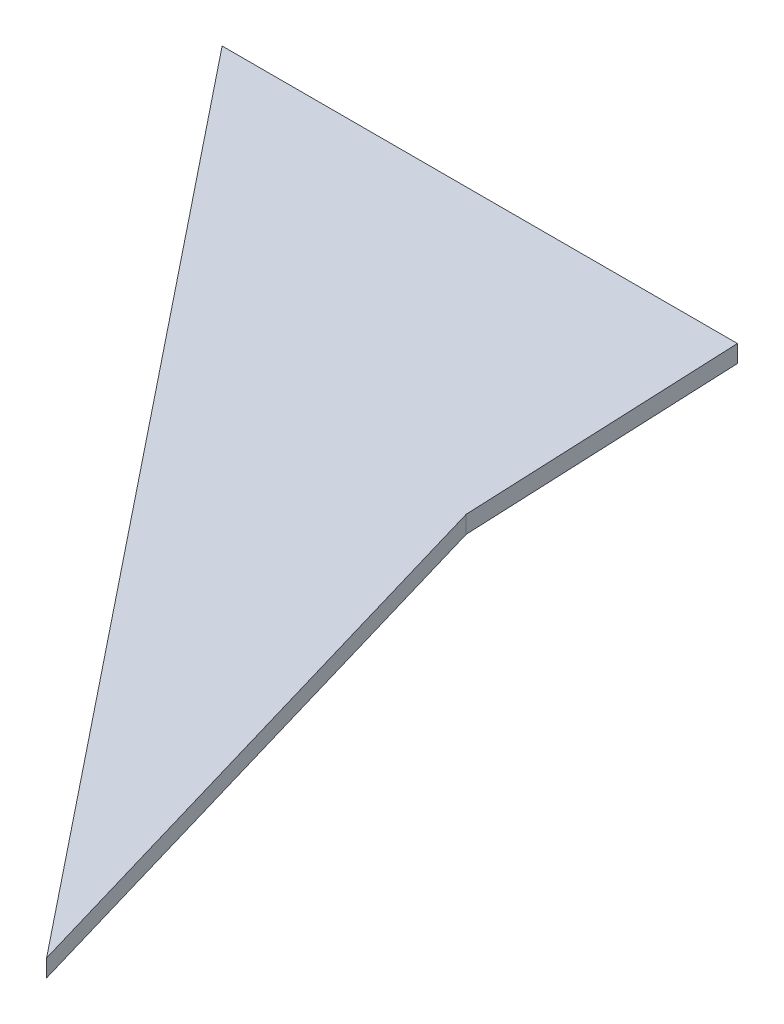
ISO-10303-21;
HEADER;
FILE_DESCRIPTION(('STEP AP214'),'2;1');
FILE_NAME('part.step','',(''),(''),'','','');
FILE_SCHEMA(('AUTOMOTIVE_DESIGN { 1 0 10303 214 1 1 1 1 }'));
ENDSEC;
DATA;
#1=APPLICATION_CONTEXT('core data for automotive mechanical design processes');
#2=APPLICATION_PROTOCOL_DEFINITION('international standard','automotive_design',2000,#1);
#3=PRODUCT_CONTEXT('',#1,'mechanical');
#4=PRODUCT('Part','Part','',(#3));
#5=PRODUCT_RELATED_PRODUCT_CATEGORY('part','',(#4));
#6=PRODUCT_DEFINITION_FORMATION('','',#4);
#7=PRODUCT_DEFINITION_CONTEXT('part definition',#1,'design');
#8=PRODUCT_DEFINITION('design','',#6,#7);
#9=PRODUCT_DEFINITION_SHAPE('','',#8);
#10=(LENGTH_UNIT() NAMED_UNIT(*) SI_UNIT(.MILLI.,.METRE.));
#11=(NAMED_UNIT(*) PLANE_ANGLE_UNIT() SI_UNIT($,.RADIAN.));
#12=(NAMED_UNIT(*) SI_UNIT($,.STERADIAN.) SOLID_ANGLE_UNIT());
#13=UNCERTAINTY_MEASURE_WITH_UNIT(LENGTH_MEASURE(1.E-05),#10,'distance_accuracy_value','');
#14=(GEOMETRIC_REPRESENTATION_CONTEXT(3) GLOBAL_UNCERTAINTY_ASSIGNED_CONTEXT((#13)) GLOBAL_UNIT_ASSIGNED_CONTEXT((#10,
#11,#12)) REPRESENTATION_CONTEXT('',''));
#15=CARTESIAN_POINT('',(0.,0.,0.));
#16=DIRECTION('',(0.,0.,1.));
#17=DIRECTION('',(1.,0.,0.));
#18=AXIS2_PLACEMENT_3D('',#15,#16,#17);
#19=CARTESIAN_POINT('',(59.3342500833334,2.,0.));
#20=DIRECTION('',(0.,0.,1.));
#21=DIRECTION('',(1.,0.,0.));
#22=AXIS2_PLACEMENT_3D('',#19,#20,#21);
#23=PLANE('',#22);
#24=DIRECTION('',(-1.,0.,0.));
#25=VECTOR('',#24,1.);
#26=CARTESIAN_POINT('',(59.3342500833334,0.,0.));
#27=LINE('',#26,#25);
#28=CARTESIAN_POINT('',(59.3342500833334,0.,0.));
#29=VERTEX_POINT('',#28);
#30=CARTESIAN_POINT('',(0.,0.,0.));
#31=VERTEX_POINT('',#30);
#32=EDGE_CURVE('E107',#29,#31,#27,.T.);
#33=ORIENTED_EDGE('',*,*,#32,.T.);
#34=DIRECTION('',(0.,-1.,0.));
#35=VECTOR('',#34,1.);
#36=CARTESIAN_POINT('',(0.,2.,0.));
#37=LINE('',#36,#35);
#38=CARTESIAN_POINT('',(0.,2.,0.));
#39=VERTEX_POINT('',#38);
#40=EDGE_CURVE('E11',#39,#31,#37,.T.);
#41=ORIENTED_EDGE('',*,*,#40,.F.);
#42=DIRECTION('',(-1.,0.,0.));
#43=VECTOR('',#42,1.);
#44=CARTESIAN_POINT('',(59.3342500833334,2.,0.));
#45=LINE('',#44,#43);
#46=CARTESIAN_POINT('',(59.3342500833334,2.,0.));
#47=VERTEX_POINT('',#46);
#48=EDGE_CURVE('E91',#47,#39,#45,.T.);
#49=ORIENTED_EDGE('',*,*,#48,.F.);
#50=DIRECTION('',(0.,-1.,0.));
#51=VECTOR('',#50,1.);
#52=CARTESIAN_POINT('',(59.3342500833334,2.,0.));
#53=LINE('',#52,#51);
#54=EDGE_CURVE('E103',#47,#29,#53,.T.);
#55=ORIENTED_EDGE('',*,*,#54,.T.);
#56=EDGE_LOOP('',(#33,#41,#49,#55));
#57=FACE_BOUND('',#56,.T.);
#58=ADVANCED_FACE('F39',(#57),#23,.F.);
#59=CARTESIAN_POINT('',(0.,2.,0.));
#60=DIRECTION('',(0.780890527240182,0.,-0.624667899340562));
#61=DIRECTION('',(-0.624667899340562,0.,-0.780890527240182));
#62=AXIS2_PLACEMENT_3D('',#59,#60,#61);
#63=PLANE('',#62);
#64=DIRECTION('',(0.624667899340562,0.,0.780890527240182));
#65=VECTOR('',#64,1.);
#66=CARTESIAN_POINT('',(0.,0.,0.));
#67=LINE('',#66,#65);
#68=CARTESIAN_POINT('',(80.8345458738802,0.,101.05038407338));
#69=VERTEX_POINT('',#68);
#70=EDGE_CURVE('E96',#31,#69,#67,.T.);
#71=ORIENTED_EDGE('',*,*,#70,.T.);
#72=DIRECTION('',(0.,-1.,0.));
#73=VECTOR('',#72,1.);
#74=CARTESIAN_POINT('',(80.8345458738802,2.,101.05038407338));
#75=LINE('',#74,#73);
#76=CARTESIAN_POINT('',(80.8345458738802,2.,101.05038407338));
#77=VERTEX_POINT('',#76);
#78=EDGE_CURVE('E48',#77,#69,#75,.T.);
#79=ORIENTED_EDGE('',*,*,#78,.F.);
#80=DIRECTION('',(0.624667899340562,0.,0.780890527240182));
#81=VECTOR('',#80,1.);
#82=CARTESIAN_POINT('',(0.,2.,0.));
#83=LINE('',#82,#81);
#84=EDGE_CURVE('E86',#39,#77,#83,.T.);
#85=ORIENTED_EDGE('',*,*,#84,.F.);
#86=ORIENTED_EDGE('',*,*,#40,.T.);
#87=EDGE_LOOP('',(#71,#79,#85,#86));
#88=FACE_BOUND('',#87,.T.);
#89=ADVANCED_FACE('F95',(#88),#63,.F.);
#90=CARTESIAN_POINT('',(80.8345458738802,2.,101.05038407338));
#91=DIRECTION('',(-0.959491480796635,0.,0.281737640862345));
#92=DIRECTION('',(0.281737640862345,0.,0.959491480796635));
#93=AXIS2_PLACEMENT_3D('',#90,#91,#92);
#94=PLANE('',#93);
#95=DIRECTION('',(-0.281737640862345,0.,-0.959491480796635));
#96=VECTOR('',#95,1.);
#97=CARTESIAN_POINT('',(80.8345458738802,0.,101.05038407338));
#98=LINE('',#97,#96);
#99=CARTESIAN_POINT('',(60.7477748252541,0.,32.6424651354699));
#100=VERTEX_POINT('',#99);
#101=EDGE_CURVE('E73',#69,#100,#98,.T.);
#102=ORIENTED_EDGE('',*,*,#101,.T.);
#103=DIRECTION('',(0.,-1.,0.));
#104=VECTOR('',#103,1.);
#105=CARTESIAN_POINT('',(60.7477748252541,2.,32.6424651354699));
#106=LINE('',#105,#104);
#107=CARTESIAN_POINT('',(60.7477748252541,2.,32.6424651354699));
#108=VERTEX_POINT('',#107);
#109=EDGE_CURVE('E98',#108,#100,#106,.T.);
#110=ORIENTED_EDGE('',*,*,#109,.F.);
#111=DIRECTION('',(-0.281737640862345,0.,-0.959491480796635));
#112=VECTOR('',#111,1.);
#113=CARTESIAN_POINT('',(80.8345458738802,2.,101.05038407338));
#114=LINE('',#113,#112);
#115=EDGE_CURVE('E89',#77,#108,#114,.T.);
#116=ORIENTED_EDGE('',*,*,#115,.F.);
#117=ORIENTED_EDGE('',*,*,#78,.T.);
#118=EDGE_LOOP('',(#102,#110,#116,#117));
#119=FACE_BOUND('',#118,.T.);
#120=ADVANCED_FACE('F99',(#119),#94,.F.);
#121=CARTESIAN_POINT('',(60.7477748252541,2.,32.6424651354699));
#122=DIRECTION('',(-0.999063730927466,0.,0.0432627038601634));
#123=DIRECTION('',(0.0432627038601634,0.,0.999063730927466));
#124=AXIS2_PLACEMENT_3D('',#121,#122,#123);
#125=PLANE('',#124);
#126=DIRECTION('',(-0.0432627038601634,0.,-0.999063730927466));
#127=VECTOR('',#126,1.);
#128=CARTESIAN_POINT('',(60.7477748252541,0.,32.6424651354699));
#129=LINE('',#128,#127);
#130=EDGE_CURVE('E79',#100,#29,#129,.T.);
#131=ORIENTED_EDGE('',*,*,#130,.T.);
#132=ORIENTED_EDGE('',*,*,#54,.F.);
#133=DIRECTION('',(-0.0432627038601634,0.,-0.999063730927466));
#134=VECTOR('',#133,1.);
#135=CARTESIAN_POINT('',(60.7477748252541,2.,32.6424651354699));
#136=LINE('',#135,#134);
#137=EDGE_CURVE('E56',#108,#47,#136,.T.);
#138=ORIENTED_EDGE('',*,*,#137,.F.);
#139=ORIENTED_EDGE('',*,*,#109,.T.);
#140=EDGE_LOOP('',(#131,#132,#138,#139));
#141=FACE_BOUND('',#140,.T.);
#142=ADVANCED_FACE('F120',(#141),#125,.F.);
#143=CARTESIAN_POINT('',(0.,2.,0.));
#144=DIRECTION('',(0.,-1.,0.));
#145=DIRECTION('',(0.,0.,-1.));
#146=AXIS2_PLACEMENT_3D('',#143,#144,#145);
#147=PLANE('',#146);
#148=ORIENTED_EDGE('',*,*,#48,.T.);
#149=ORIENTED_EDGE('',*,*,#84,.T.);
#150=ORIENTED_EDGE('',*,*,#115,.T.);
#151=ORIENTED_EDGE('',*,*,#137,.T.);
#152=EDGE_LOOP('',(#148,#149,#150,#151));
#153=FACE_BOUND('',#152,.T.);
#154=ADVANCED_FACE('F87',(#153),#147,.F.);
#155=CARTESIAN_POINT('',(0.,0.,0.));
#156=DIRECTION('',(0.,-1.,0.));
#157=DIRECTION('',(0.,0.,-1.));
#158=AXIS2_PLACEMENT_3D('',#155,#156,#157);
#159=PLANE('',#158);
#160=ORIENTED_EDGE('',*,*,#32,.F.);
#161=ORIENTED_EDGE('',*,*,#130,.F.);
#162=ORIENTED_EDGE('',*,*,#101,.F.);
#163=ORIENTED_EDGE('',*,*,#70,.F.);
#164=EDGE_LOOP('',(#160,#161,#162,#163));
#165=FACE_BOUND('',#164,.T.);
#166=ADVANCED_FACE('F123',(#165),#159,.T.);
#167=CLOSED_SHELL('',(#58,#89,#120,#142,#154,#166));
#168=MANIFOLD_SOLID_BREP('B2',#167);
#169=ADVANCED_BREP_SHAPE_REPRESENTATION('',(#18,#168),#14);
#170=SHAPE_DEFINITION_REPRESENTATION(#9,#169);
ENDSEC;
END-ISO-10303-21;
